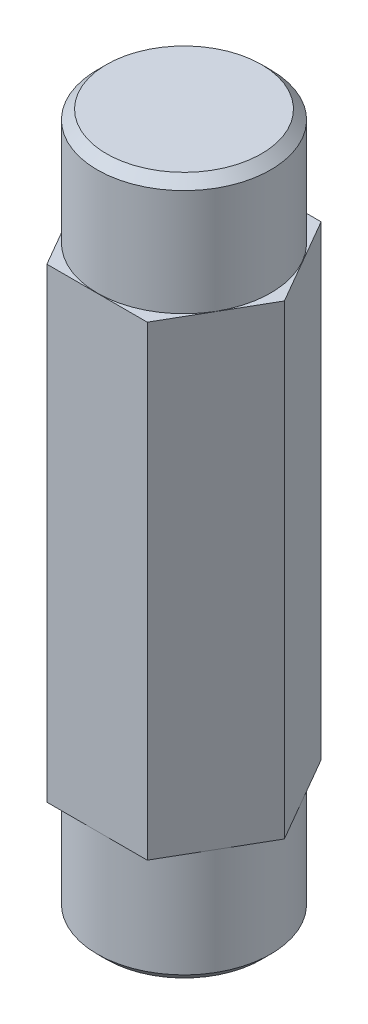
ISO-10303-21;
HEADER;
FILE_DESCRIPTION(('STEP AP214'),'2;1');
FILE_NAME('part.step','',(''),(''),'','','');
FILE_SCHEMA(('AUTOMOTIVE_DESIGN { 1 0 10303 214 1 1 1 1 }'));
ENDSEC;
DATA;
#1=APPLICATION_CONTEXT('core data for automotive mechanical design processes');
#2=APPLICATION_PROTOCOL_DEFINITION('international standard','automotive_design',2000,#1);
#3=PRODUCT_CONTEXT('',#1,'mechanical');
#4=PRODUCT('Part','Part','',(#3));
#5=PRODUCT_RELATED_PRODUCT_CATEGORY('part','',(#4));
#6=PRODUCT_DEFINITION_FORMATION('','',#4);
#7=PRODUCT_DEFINITION_CONTEXT('part definition',#1,'design');
#8=PRODUCT_DEFINITION('design','',#6,#7);
#9=PRODUCT_DEFINITION_SHAPE('','',#8);
#10=(LENGTH_UNIT() NAMED_UNIT(*) SI_UNIT(.MILLI.,.METRE.));
#11=(NAMED_UNIT(*) PLANE_ANGLE_UNIT() SI_UNIT($,.RADIAN.));
#12=(NAMED_UNIT(*) SI_UNIT($,.STERADIAN.) SOLID_ANGLE_UNIT());
#13=UNCERTAINTY_MEASURE_WITH_UNIT(LENGTH_MEASURE(1.E-05),#10,'distance_accuracy_value','');
#14=(GEOMETRIC_REPRESENTATION_CONTEXT(3) GLOBAL_UNCERTAINTY_ASSIGNED_CONTEXT((#13)) GLOBAL_UNIT_ASSIGNED_CONTEXT((#10,
#11,#12)) REPRESENTATION_CONTEXT('',''));
#15=CARTESIAN_POINT('',(0.,0.,0.));
#16=DIRECTION('',(0.,0.,1.));
#17=DIRECTION('',(1.,0.,0.));
#18=AXIS2_PLACEMENT_3D('',#15,#16,#17);
#19=CARTESIAN_POINT('',(-39.2241243202131,6.35,-16.6661167863655));
#20=DIRECTION('',(0.,-1.,0.));
#21=DIRECTION('',(0.,0.,-1.));
#22=AXIS2_PLACEMENT_3D('',#19,#20,#21);
#23=PLANE('',#22);
#24=CARTESIAN_POINT('',(-39.2241243202131,6.34999999994079,-16.6661167863655));
#25=DIRECTION('',(0.,-1.,0.));
#26=DIRECTION('',(0.,0.,-1.));
#27=AXIS2_PLACEMENT_3D('',#24,#25,#26);
#28=CIRCLE('',#27,4.24180000000511);
#29=CARTESIAN_POINT('',(-39.2241243202131,6.34999999994079,-20.9079167863706));
#30=VERTEX_POINT('',#29);
#31=EDGE_CURVE('E19',#30,#30,#28,.T.);
#32=ORIENTED_EDGE('',*,*,#31,.F.);
#33=EDGE_LOOP('',(#32));
#34=FACE_BOUND('',#33,.T.);
#35=ADVANCED_FACE('F16',(#34),#23,.F.);
#36=CARTESIAN_POINT('',(-39.2241243202131,5.8420000000865,-16.6661167863655));
#37=DIRECTION('',(0.,-1.,0.));
#38=DIRECTION('',(0.,0.,-1.));
#39=AXIS2_PLACEMENT_3D('',#36,#37,#38);
#40=CONICAL_SURFACE('',#39,4.74979999991624,0.785398163453397);
#41=CARTESIAN_POINT('',(-39.2241243202131,5.842,-16.6661167863655));
#42=DIRECTION('',(0.,1.,0.));
#43=DIRECTION('',(0.,0.,1.));
#44=AXIS2_PLACEMENT_3D('',#41,#42,#43);
#45=CIRCLE('',#44,4.7498);
#46=CARTESIAN_POINT('',(-39.2241243202131,5.842,-11.9163167863655));
#47=VERTEX_POINT('',#46);
#48=EDGE_CURVE('E97',#47,#47,#45,.F.);
#49=ORIENTED_EDGE('',*,*,#48,.F.);
#50=EDGE_LOOP('',(#49));
#51=FACE_BOUND('',#50,.T.);
#52=ORIENTED_EDGE('',*,*,#31,.T.);
#53=EDGE_LOOP('',(#52));
#54=FACE_BOUND('',#53,.T.);
#55=ADVANCED_FACE('F120',(#51,#54),#40,.T.);
#56=CARTESIAN_POINT('',(-39.2241243202131,6.35,-16.6661167863655));
#57=DIRECTION('',(0.,1.,0.));
#58=DIRECTION('',(0.,0.,1.));
#59=AXIS2_PLACEMENT_3D('',#56,#57,#58);
#60=CYLINDRICAL_SURFACE('',#59,4.7498);
#61=CARTESIAN_POINT('',(-39.2241243202131,0.,-16.6661167863655));
#62=DIRECTION('',(0.,1.,0.));
#63=DIRECTION('',(0.,0.,1.));
#64=AXIS2_PLACEMENT_3D('',#61,#62,#63);
#65=CIRCLE('',#64,4.7498);
#66=CARTESIAN_POINT('',(-39.2241243202131,0.,-11.9163167863655));
#67=VERTEX_POINT('',#66);
#68=EDGE_CURVE('E86',#67,#67,#65,.T.);
#69=ORIENTED_EDGE('',*,*,#68,.T.);
#70=EDGE_LOOP('',(#69));
#71=FACE_BOUND('',#70,.T.);
#72=ORIENTED_EDGE('',*,*,#48,.T.);
#73=EDGE_LOOP('',(#72));
#74=FACE_BOUND('',#73,.T.);
#75=ADVANCED_FACE('F108',(#71,#74),#60,.T.);
#76=CARTESIAN_POINT('',(-44.7233856342443,0.,-16.6661167863655));
#77=DIRECTION('',(0.,-1.,0.));
#78=DIRECTION('',(0.,0.,-1.));
#79=AXIS2_PLACEMENT_3D('',#76,#77,#78);
#80=PLANE('',#79);
#81=DIRECTION('',(1.,0.,0.));
#82=VECTOR('',#81,1.);
#83=CARTESIAN_POINT('',(-41.9737549772287,0.,-11.9036167863655));
#84=LINE('',#83,#82);
#85=CARTESIAN_POINT('',(-36.4744936631975,0.,-11.9036167863655));
#86=VERTEX_POINT('',#85);
#87=CARTESIAN_POINT('',(-41.9737549772287,0.,-11.9036167863655));
#88=VERTEX_POINT('',#87);
#89=EDGE_CURVE('E269',#86,#88,#84,.F.);
#90=ORIENTED_EDGE('',*,*,#89,.F.);
#91=DIRECTION('',(0.500000000000001,0.,-0.866025403784438));
#92=VECTOR('',#91,1.);
#93=CARTESIAN_POINT('',(-36.4744936631975,0.,-11.9036167863655));
#94=LINE('',#93,#92);
#95=CARTESIAN_POINT('',(-33.7248630061819,0.,-16.6661167863655));
#96=VERTEX_POINT('',#95);
#97=EDGE_CURVE('E274',#96,#86,#94,.F.);
#98=ORIENTED_EDGE('',*,*,#97,.F.);
#99=DIRECTION('',(-0.5,0.,-0.866025403784439));
#100=VECTOR('',#99,1.);
#101=CARTESIAN_POINT('',(-33.7248630061819,0.,-16.6661167863655));
#102=LINE('',#101,#100);
#103=CARTESIAN_POINT('',(-36.4744936631975,0.,-21.4286167863655));
#104=VERTEX_POINT('',#103);
#105=EDGE_CURVE('E277',#104,#96,#102,.F.);
#106=ORIENTED_EDGE('',*,*,#105,.F.);
#107=DIRECTION('',(-1.,0.,0.));
#108=VECTOR('',#107,1.);
#109=CARTESIAN_POINT('',(-36.4744936631975,0.,-21.4286167863655));
#110=LINE('',#109,#108);
#111=CARTESIAN_POINT('',(-41.9737549772287,0.,-21.4286167863655));
#112=VERTEX_POINT('',#111);
#113=EDGE_CURVE('E67',#112,#104,#110,.F.);
#114=ORIENTED_EDGE('',*,*,#113,.F.);
#115=DIRECTION('',(-0.500000000000001,0.,0.866025403784438));
#116=VECTOR('',#115,1.);
#117=CARTESIAN_POINT('',(-41.9737549772287,0.,-21.4286167863655));
#118=LINE('',#117,#116);
#119=CARTESIAN_POINT('',(-44.7233856342443,0.,-16.6661167863655));
#120=VERTEX_POINT('',#119);
#121=EDGE_CURVE('E69',#120,#112,#118,.F.);
#122=ORIENTED_EDGE('',*,*,#121,.F.);
#123=DIRECTION('',(0.5,0.,0.866025403784439));
#124=VECTOR('',#123,1.);
#125=CARTESIAN_POINT('',(-44.7233856342443,0.,-16.6661167863655));
#126=LINE('',#125,#124);
#127=EDGE_CURVE('E73',#88,#120,#126,.F.);
#128=ORIENTED_EDGE('',*,*,#127,.F.);
#129=EDGE_LOOP('',(#90,#98,#106,#114,#122,#128));
#130=FACE_BOUND('',#129,.T.);
#131=ORIENTED_EDGE('',*,*,#68,.F.);
#132=EDGE_LOOP('',(#131));
#133=FACE_BOUND('',#132,.T.);
#134=ADVANCED_FACE('F71',(#130,#133),#80,.F.);
#135=CARTESIAN_POINT('',(-39.2241243202131,-31.877,-16.6661167863655));
#136=DIRECTION('',(0.,1.,0.));
#137=DIRECTION('',(0.,0.,1.));
#138=AXIS2_PLACEMENT_3D('',#135,#136,#137);
#139=PLANE('',#138);
#140=CARTESIAN_POINT('',(-39.2241243202131,-31.8770000000654,-16.6661167863655));
#141=DIRECTION('',(0.,1.,0.));
#142=DIRECTION('',(0.,0.,1.));
#143=AXIS2_PLACEMENT_3D('',#140,#141,#142);
#144=CIRCLE('',#143,4.24179999997172);
#145=CARTESIAN_POINT('',(-39.2241243202131,-31.8770000000654,-12.4243167863938));
#146=VERTEX_POINT('',#145);
#147=EDGE_CURVE('E102',#146,#146,#144,.T.);
#148=ORIENTED_EDGE('',*,*,#147,.F.);
#149=EDGE_LOOP('',(#148));
#150=FACE_BOUND('',#149,.T.);
#151=ADVANCED_FACE('F111',(#150),#139,.F.);
#152=CARTESIAN_POINT('',(-44.7233856342443,-25.527,-16.6661167863655));
#153=DIRECTION('',(-0.866025403784439,0.,0.5));
#154=DIRECTION('',(0.5,0.,0.866025403784439));
#155=AXIS2_PLACEMENT_3D('',#152,#153,#154);
#156=PLANE('',#155);
#157=DIRECTION('',(-0.500000000000001,0.,-0.866025403784438));
#158=VECTOR('',#157,1.);
#159=CARTESIAN_POINT('',(-41.9737549772287,-25.527,-11.9036167863655));
#160=LINE('',#159,#158);
#161=CARTESIAN_POINT('',(-41.9737549772287,-25.527,-11.9036167863655));
#162=VERTEX_POINT('',#161);
#163=CARTESIAN_POINT('',(-44.7233856342443,-25.527,-16.6661167863655));
#164=VERTEX_POINT('',#163);
#165=EDGE_CURVE('E104',#162,#164,#160,.T.);
#166=ORIENTED_EDGE('',*,*,#165,.F.);
#167=DIRECTION('',(0.,1.,0.));
#168=VECTOR('',#167,1.);
#169=CARTESIAN_POINT('',(-41.9737549772287,-25.527,-11.9036167863655));
#170=LINE('',#169,#168);
#171=EDGE_CURVE('E84',#88,#162,#170,.F.);
#172=ORIENTED_EDGE('',*,*,#171,.F.);
#173=ORIENTED_EDGE('',*,*,#127,.T.);
#174=DIRECTION('',(0.,1.,0.));
#175=VECTOR('',#174,1.);
#176=CARTESIAN_POINT('',(-44.7233856342443,-25.527,-16.6661167863655));
#177=LINE('',#176,#175);
#178=EDGE_CURVE('E78',#164,#120,#177,.T.);
#179=ORIENTED_EDGE('',*,*,#178,.F.);
#180=EDGE_LOOP('',(#166,#172,#173,#179));
#181=FACE_BOUND('',#180,.T.);
#182=ADVANCED_FACE('F81',(#181),#156,.T.);
#183=CARTESIAN_POINT('',(-41.9737549772287,-25.527,-21.4286167863655));
#184=DIRECTION('',(-0.866025403784438,0.,-0.500000000000001));
#185=DIRECTION('',(-0.500000000000001,0.,0.866025403784438));
#186=AXIS2_PLACEMENT_3D('',#183,#184,#185);
#187=PLANE('',#186);
#188=DIRECTION('',(0.500000000000001,0.,-0.866025403784438));
#189=VECTOR('',#188,1.);
#190=CARTESIAN_POINT('',(-44.7233856342443,-25.527,-16.6661167863655));
#191=LINE('',#190,#189);
#192=CARTESIAN_POINT('',(-41.9737549772287,-25.527,-21.4286167863655));
#193=VERTEX_POINT('',#192);
#194=EDGE_CURVE('E90',#164,#193,#191,.T.);
#195=ORIENTED_EDGE('',*,*,#194,.F.);
#196=ORIENTED_EDGE('',*,*,#178,.T.);
#197=ORIENTED_EDGE('',*,*,#121,.T.);
#198=DIRECTION('',(0.,1.,0.));
#199=VECTOR('',#198,1.);
#200=CARTESIAN_POINT('',(-41.9737549772287,-25.527,-21.4286167863655));
#201=LINE('',#200,#199);
#202=EDGE_CURVE('E93',#193,#112,#201,.T.);
#203=ORIENTED_EDGE('',*,*,#202,.F.);
#204=EDGE_LOOP('',(#195,#196,#197,#203));
#205=FACE_BOUND('',#204,.T.);
#206=ADVANCED_FACE('F88',(#205),#187,.T.);
#207=CARTESIAN_POINT('',(-36.4744936631975,-25.527,-21.4286167863655));
#208=DIRECTION('',(0.,0.,-1.));
#209=DIRECTION('',(-1.,0.,0.));
#210=AXIS2_PLACEMENT_3D('',#207,#208,#209);
#211=PLANE('',#210);
#212=DIRECTION('',(1.,0.,0.));
#213=VECTOR('',#212,1.);
#214=CARTESIAN_POINT('',(-44.7233856342443,-25.527,-21.4286167863655));
#215=LINE('',#214,#213);
#216=CARTESIAN_POINT('',(-36.4744936631975,-25.527,-21.4286167863655));
#217=VERTEX_POINT('',#216);
#218=EDGE_CURVE('E253',#193,#217,#215,.T.);
#219=ORIENTED_EDGE('',*,*,#218,.F.);
#220=ORIENTED_EDGE('',*,*,#202,.T.);
#221=ORIENTED_EDGE('',*,*,#113,.T.);
#222=DIRECTION('',(0.,1.,0.));
#223=VECTOR('',#222,1.);
#224=CARTESIAN_POINT('',(-36.4744936631975,-25.527,-21.4286167863655));
#225=LINE('',#224,#223);
#226=EDGE_CURVE('E255',#217,#104,#225,.T.);
#227=ORIENTED_EDGE('',*,*,#226,.F.);
#228=EDGE_LOOP('',(#219,#220,#221,#227));
#229=FACE_BOUND('',#228,.T.);
#230=ADVANCED_FACE('F148',(#229),#211,.T.);
#231=CARTESIAN_POINT('',(-33.7248630061819,-25.527,-16.6661167863655));
#232=DIRECTION('',(0.866025403784439,0.,-0.5));
#233=DIRECTION('',(-0.5,0.,-0.866025403784439));
#234=AXIS2_PLACEMENT_3D('',#231,#232,#233);
#235=PLANE('',#234);
#236=DIRECTION('',(0.500000000000002,0.,0.866025403784438));
#237=VECTOR('',#236,1.);
#238=CARTESIAN_POINT('',(-36.4744936631975,-25.527,-21.4286167863655));
#239=LINE('',#238,#237);
#240=CARTESIAN_POINT('',(-33.7248630061819,-25.527,-16.6661167863655));
#241=VERTEX_POINT('',#240);
#242=EDGE_CURVE('E258',#217,#241,#239,.T.);
#243=ORIENTED_EDGE('',*,*,#242,.F.);
#244=ORIENTED_EDGE('',*,*,#226,.T.);
#245=ORIENTED_EDGE('',*,*,#105,.T.);
#246=DIRECTION('',(0.,1.,0.));
#247=VECTOR('',#246,1.);
#248=CARTESIAN_POINT('',(-33.7248630061819,-25.527,-16.6661167863655));
#249=LINE('',#248,#247);
#250=EDGE_CURVE('E271',#241,#96,#249,.T.);
#251=ORIENTED_EDGE('',*,*,#250,.F.);
#252=EDGE_LOOP('',(#243,#244,#245,#251));
#253=FACE_BOUND('',#252,.T.);
#254=ADVANCED_FACE('F145',(#253),#235,.T.);
#255=CARTESIAN_POINT('',(-36.4744936631975,-25.527,-11.9036167863655));
#256=DIRECTION('',(0.866025403784438,0.,0.500000000000001));
#257=DIRECTION('',(0.500000000000001,0.,-0.866025403784438));
#258=AXIS2_PLACEMENT_3D('',#255,#256,#257);
#259=PLANE('',#258);
#260=DIRECTION('',(-0.500000000000002,0.,0.866025403784438));
#261=VECTOR('',#260,1.);
#262=CARTESIAN_POINT('',(-33.7248630061819,-25.527,-16.6661167863655));
#263=LINE('',#262,#261);
#264=CARTESIAN_POINT('',(-36.4744936631975,-25.527,-11.9036167863655));
#265=VERTEX_POINT('',#264);
#266=EDGE_CURVE('E279',#241,#265,#263,.T.);
#267=ORIENTED_EDGE('',*,*,#266,.F.);
#268=ORIENTED_EDGE('',*,*,#250,.T.);
#269=ORIENTED_EDGE('',*,*,#97,.T.);
#270=DIRECTION('',(0.,1.,0.));
#271=VECTOR('',#270,1.);
#272=CARTESIAN_POINT('',(-36.4744936631975,-25.527,-11.9036167863655));
#273=LINE('',#272,#271);
#274=EDGE_CURVE('E34',#265,#86,#273,.T.);
#275=ORIENTED_EDGE('',*,*,#274,.F.);
#276=EDGE_LOOP('',(#267,#268,#269,#275));
#277=FACE_BOUND('',#276,.T.);
#278=ADVANCED_FACE('F141',(#277),#259,.T.);
#279=CARTESIAN_POINT('',(-41.9737549772287,-25.527,-11.9036167863655));
#280=DIRECTION('',(0.,0.,1.));
#281=DIRECTION('',(1.,0.,0.));
#282=AXIS2_PLACEMENT_3D('',#279,#280,#281);
#283=PLANE('',#282);
#284=DIRECTION('',(1.,0.,0.));
#285=VECTOR('',#284,1.);
#286=CARTESIAN_POINT('',(-44.7233856342443,-25.527,-11.9036167863655));
#287=LINE('',#286,#285);
#288=EDGE_CURVE('E280',#265,#162,#287,.F.);
#289=ORIENTED_EDGE('',*,*,#288,.F.);
#290=ORIENTED_EDGE('',*,*,#274,.T.);
#291=ORIENTED_EDGE('',*,*,#89,.T.);
#292=ORIENTED_EDGE('',*,*,#171,.T.);
#293=EDGE_LOOP('',(#289,#290,#291,#292));
#294=FACE_BOUND('',#293,.T.);
#295=ADVANCED_FACE('F137',(#294),#283,.T.);
#296=CARTESIAN_POINT('',(-39.2241243202131,-31.3689999999838,-16.6661167863655));
#297=DIRECTION('',(0.,1.,0.));
#298=DIRECTION('',(0.,0.,1.));
#299=AXIS2_PLACEMENT_3D('',#296,#297,#298);
#300=CONICAL_SURFACE('',#299,4.74980000005339,0.785398163397448);
#301=CARTESIAN_POINT('',(-39.2241243202131,-31.369,-16.6661167863655));
#302=DIRECTION('',(0.,-1.,0.));
#303=DIRECTION('',(0.,0.,-1.));
#304=AXIS2_PLACEMENT_3D('',#301,#302,#303);
#305=CIRCLE('',#304,4.7498);
#306=CARTESIAN_POINT('',(-39.2241243202131,-31.369,-21.4159167863655));
#307=VERTEX_POINT('',#306);
#308=EDGE_CURVE('E25',#307,#307,#305,.F.);
#309=ORIENTED_EDGE('',*,*,#308,.F.);
#310=EDGE_LOOP('',(#309));
#311=FACE_BOUND('',#310,.T.);
#312=ORIENTED_EDGE('',*,*,#147,.T.);
#313=EDGE_LOOP('',(#312));
#314=FACE_BOUND('',#313,.T.);
#315=ADVANCED_FACE('F130',(#311,#314),#300,.T.);
#316=CARTESIAN_POINT('',(-44.7233856342443,-25.527,-16.6661167863655));
#317=DIRECTION('',(0.,-1.,0.));
#318=DIRECTION('',(0.,0.,-1.));
#319=AXIS2_PLACEMENT_3D('',#316,#317,#318);
#320=PLANE('',#319);
#321=ORIENTED_EDGE('',*,*,#266,.T.);
#322=ORIENTED_EDGE('',*,*,#288,.T.);
#323=ORIENTED_EDGE('',*,*,#165,.T.);
#324=ORIENTED_EDGE('',*,*,#194,.T.);
#325=ORIENTED_EDGE('',*,*,#218,.T.);
#326=ORIENTED_EDGE('',*,*,#242,.T.);
#327=EDGE_LOOP('',(#321,#322,#323,#324,#325,#326));
#328=FACE_BOUND('',#327,.T.);
#329=CARTESIAN_POINT('',(-39.2241243202131,-25.527,-16.6661167863655));
#330=DIRECTION('',(0.,-1.,0.));
#331=DIRECTION('',(0.,0.,-1.));
#332=AXIS2_PLACEMENT_3D('',#329,#330,#331);
#333=CIRCLE('',#332,4.7498);
#334=CARTESIAN_POINT('',(-39.2241243202131,-25.527,-21.4159167863655));
#335=VERTEX_POINT('',#334);
#336=EDGE_CURVE('E11',#335,#335,#333,.T.);
#337=ORIENTED_EDGE('',*,*,#336,.F.);
#338=EDGE_LOOP('',(#337));
#339=FACE_BOUND('',#338,.T.);
#340=ADVANCED_FACE('F124',(#328,#339),#320,.T.);
#341=CARTESIAN_POINT('',(-39.2241243202131,-31.877,-16.6661167863655));
#342=DIRECTION('',(0.,-1.,0.));
#343=DIRECTION('',(0.,0.,-1.));
#344=AXIS2_PLACEMENT_3D('',#341,#342,#343);
#345=CYLINDRICAL_SURFACE('',#344,4.7498);
#346=ORIENTED_EDGE('',*,*,#336,.T.);
#347=EDGE_LOOP('',(#346));
#348=FACE_BOUND('',#347,.T.);
#349=ORIENTED_EDGE('',*,*,#308,.T.);
#350=EDGE_LOOP('',(#349));
#351=FACE_BOUND('',#350,.T.);
#352=ADVANCED_FACE('F122',(#348,#351),#345,.T.);
#353=CLOSED_SHELL('',(#35,#55,#75,#134,#151,#182,#206,#230,#254,#278,#295,#315,#340,#352));
#354=MANIFOLD_SOLID_BREP('B1',#353);
#355=ADVANCED_BREP_SHAPE_REPRESENTATION('',(#18,#354),#14);
#356=SHAPE_DEFINITION_REPRESENTATION(#9,#355);
ENDSEC;
END-ISO-10303-21;
